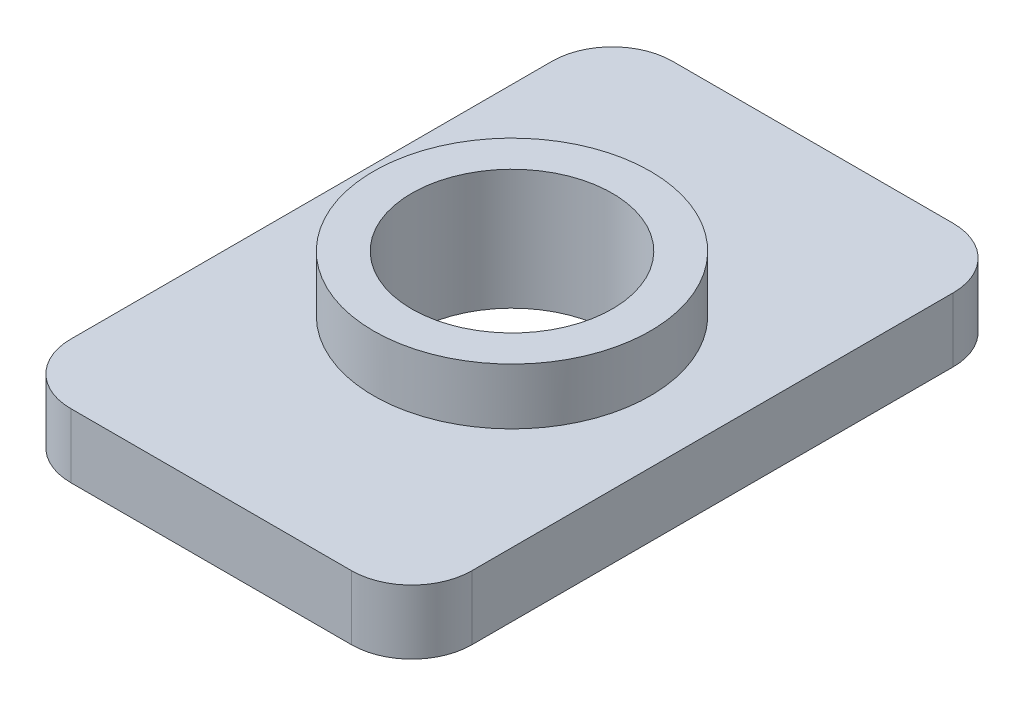
ISO-10303-21;
HEADER;
FILE_DESCRIPTION(('STEP AP214'),'2;1');
FILE_NAME('part.step','',(''),(''),'','','');
FILE_SCHEMA(('AUTOMOTIVE_DESIGN { 1 0 10303 214 1 1 1 1 }'));
ENDSEC;
DATA;
#1=APPLICATION_CONTEXT('core data for automotive mechanical design processes');
#2=APPLICATION_PROTOCOL_DEFINITION('international standard','automotive_design',2000,#1);
#3=PRODUCT_CONTEXT('',#1,'mechanical');
#4=PRODUCT('Part','Part','',(#3));
#5=PRODUCT_RELATED_PRODUCT_CATEGORY('part','',(#4));
#6=PRODUCT_DEFINITION_FORMATION('','',#4);
#7=PRODUCT_DEFINITION_CONTEXT('part definition',#1,'design');
#8=PRODUCT_DEFINITION('design','',#6,#7);
#9=PRODUCT_DEFINITION_SHAPE('','',#8);
#10=(LENGTH_UNIT() NAMED_UNIT(*) SI_UNIT(.MILLI.,.METRE.));
#11=(NAMED_UNIT(*) PLANE_ANGLE_UNIT() SI_UNIT($,.RADIAN.));
#12=(NAMED_UNIT(*) SI_UNIT($,.STERADIAN.) SOLID_ANGLE_UNIT());
#13=UNCERTAINTY_MEASURE_WITH_UNIT(LENGTH_MEASURE(1.E-05),#10,'distance_accuracy_value','');
#14=(GEOMETRIC_REPRESENTATION_CONTEXT(3) GLOBAL_UNCERTAINTY_ASSIGNED_CONTEXT((#13)) GLOBAL_UNIT_ASSIGNED_CONTEXT((#10,
#11,#12)) REPRESENTATION_CONTEXT('',''));
#15=CARTESIAN_POINT('',(0.,0.,0.));
#16=DIRECTION('',(0.,0.,1.));
#17=DIRECTION('',(1.,0.,0.));
#18=AXIS2_PLACEMENT_3D('',#15,#16,#17);
#19=CARTESIAN_POINT('',(0.,1.6,0.));
#20=DIRECTION('',(0.,-1.,0.));
#21=DIRECTION('',(0.,0.,-1.));
#22=AXIS2_PLACEMENT_3D('',#19,#20,#21);
#23=PLANE('',#22);
#24=DIRECTION('',(0.,0.,-1.));
#25=VECTOR('',#24,1.);
#26=CARTESIAN_POINT('',(5.,1.6,-7.5));
#27=LINE('',#26,#25);
#28=CARTESIAN_POINT('',(5.,1.6,6.));
#29=VERTEX_POINT('',#28);
#30=CARTESIAN_POINT('',(5.,1.6,-6.));
#31=VERTEX_POINT('',#30);
#32=EDGE_CURVE('E168',#29,#31,#27,.T.);
#33=ORIENTED_EDGE('',*,*,#32,.T.);
#34=CARTESIAN_POINT('',(3.5,1.6,-6.));
#35=DIRECTION('',(0.,-1.,0.));
#36=DIRECTION('',(0.,0.,-1.));
#37=AXIS2_PLACEMENT_3D('',#34,#35,#36);
#38=CIRCLE('',#37,1.5);
#39=CARTESIAN_POINT('',(3.5,1.6,-7.5));
#40=VERTEX_POINT('',#39);
#41=EDGE_CURVE('E150',#31,#40,#38,.F.);
#42=ORIENTED_EDGE('',*,*,#41,.T.);
#43=DIRECTION('',(-1.,0.,0.));
#44=VECTOR('',#43,1.);
#45=CARTESIAN_POINT('',(5.,1.6,-7.5));
#46=LINE('',#45,#44);
#47=CARTESIAN_POINT('',(-3.5,1.6,-7.5));
#48=VERTEX_POINT('',#47);
#49=EDGE_CURVE('E121',#40,#48,#46,.T.);
#50=ORIENTED_EDGE('',*,*,#49,.T.);
#51=CARTESIAN_POINT('',(-3.5,1.6,-6.));
#52=DIRECTION('',(0.,-1.,0.));
#53=DIRECTION('',(0.,0.,-1.));
#54=AXIS2_PLACEMENT_3D('',#51,#52,#53);
#55=CIRCLE('',#54,1.5);
#56=CARTESIAN_POINT('',(-5.,1.6,-6.));
#57=VERTEX_POINT('',#56);
#58=EDGE_CURVE('E148',#48,#57,#55,.F.);
#59=ORIENTED_EDGE('',*,*,#58,.T.);
#60=DIRECTION('',(0.,0.,1.));
#61=VECTOR('',#60,1.);
#62=CARTESIAN_POINT('',(-5.,1.6,-7.5));
#63=LINE('',#62,#61);
#64=CARTESIAN_POINT('',(-5.,1.6,6.));
#65=VERTEX_POINT('',#64);
#66=EDGE_CURVE('E128',#57,#65,#63,.T.);
#67=ORIENTED_EDGE('',*,*,#66,.T.);
#68=CARTESIAN_POINT('',(-3.5,1.6,6.));
#69=DIRECTION('',(0.,-1.,0.));
#70=DIRECTION('',(0.,0.,-1.));
#71=AXIS2_PLACEMENT_3D('',#68,#69,#70);
#72=CIRCLE('',#71,1.5);
#73=CARTESIAN_POINT('',(-3.5,1.6,7.5));
#74=VERTEX_POINT('',#73);
#75=EDGE_CURVE('E56',#65,#74,#72,.F.);
#76=ORIENTED_EDGE('',*,*,#75,.T.);
#77=DIRECTION('',(1.,0.,0.));
#78=VECTOR('',#77,1.);
#79=CARTESIAN_POINT('',(5.,1.6,7.5));
#80=LINE('',#79,#78);
#81=CARTESIAN_POINT('',(3.5,1.6,7.5));
#82=VERTEX_POINT('',#81);
#83=EDGE_CURVE('E131',#74,#82,#80,.T.);
#84=ORIENTED_EDGE('',*,*,#83,.T.);
#85=CARTESIAN_POINT('',(3.5,1.6,6.));
#86=DIRECTION('',(0.,-1.,0.));
#87=DIRECTION('',(0.,0.,-1.));
#88=AXIS2_PLACEMENT_3D('',#85,#86,#87);
#89=CIRCLE('',#88,1.5);
#90=EDGE_CURVE('E145',#82,#29,#89,.F.);
#91=ORIENTED_EDGE('',*,*,#90,.T.);
#92=EDGE_LOOP('',(#33,#42,#50,#59,#67,#76,#84,#91));
#93=FACE_BOUND('',#92,.T.);
#94=CARTESIAN_POINT('',(0.,1.6,0.));
#95=DIRECTION('',(0.,-1.,0.));
#96=DIRECTION('',(0.,0.,-1.));
#97=AXIS2_PLACEMENT_3D('',#94,#95,#96);
#98=CIRCLE('',#97,3.45);
#99=CARTESIAN_POINT('',(0.,1.6,-3.45));
#100=VERTEX_POINT('',#99);
#101=EDGE_CURVE('E11',#100,#100,#98,.F.);
#102=ORIENTED_EDGE('',*,*,#101,.F.);
#103=EDGE_LOOP('',(#102));
#104=FACE_BOUND('',#103,.T.);
#105=ADVANCED_FACE('F34',(#93,#104),#23,.F.);
#106=CARTESIAN_POINT('',(0.,0.,0.));
#107=DIRECTION('',(0.,-1.,0.));
#108=DIRECTION('',(0.,0.,-1.));
#109=AXIS2_PLACEMENT_3D('',#106,#107,#108);
#110=PLANE('',#109);
#111=DIRECTION('',(-1.,0.,0.));
#112=VECTOR('',#111,1.);
#113=CARTESIAN_POINT('',(5.,0.,-7.5));
#114=LINE('',#113,#112);
#115=CARTESIAN_POINT('',(3.5,0.,-7.5));
#116=VERTEX_POINT('',#115);
#117=CARTESIAN_POINT('',(-3.5,0.,-7.5));
#118=VERTEX_POINT('',#117);
#119=EDGE_CURVE('E118',#116,#118,#114,.T.);
#120=ORIENTED_EDGE('',*,*,#119,.F.);
#121=CARTESIAN_POINT('',(3.5,0.,-6.));
#122=DIRECTION('',(0.,-1.,0.));
#123=DIRECTION('',(0.,0.,-1.));
#124=AXIS2_PLACEMENT_3D('',#121,#122,#123);
#125=CIRCLE('',#124,1.5);
#126=CARTESIAN_POINT('',(5.,0.,-6.));
#127=VERTEX_POINT('',#126);
#128=EDGE_CURVE('E101',#116,#127,#125,.T.);
#129=ORIENTED_EDGE('',*,*,#128,.T.);
#130=DIRECTION('',(0.,0.,-1.));
#131=VECTOR('',#130,1.);
#132=CARTESIAN_POINT('',(5.,0.,-7.5));
#133=LINE('',#132,#131);
#134=CARTESIAN_POINT('',(5.,0.,6.));
#135=VERTEX_POINT('',#134);
#136=EDGE_CURVE('E129',#135,#127,#133,.T.);
#137=ORIENTED_EDGE('',*,*,#136,.F.);
#138=CARTESIAN_POINT('',(3.5,0.,6.));
#139=DIRECTION('',(0.,-1.,0.));
#140=DIRECTION('',(0.,0.,-1.));
#141=AXIS2_PLACEMENT_3D('',#138,#139,#140);
#142=CIRCLE('',#141,1.5);
#143=CARTESIAN_POINT('',(3.5,0.,7.5));
#144=VERTEX_POINT('',#143);
#145=EDGE_CURVE('E122',#135,#144,#142,.T.);
#146=ORIENTED_EDGE('',*,*,#145,.T.);
#147=DIRECTION('',(1.,0.,0.));
#148=VECTOR('',#147,1.);
#149=CARTESIAN_POINT('',(5.,0.,7.5));
#150=LINE('',#149,#148);
#151=CARTESIAN_POINT('',(-3.5,0.,7.5));
#152=VERTEX_POINT('',#151);
#153=EDGE_CURVE('E133',#152,#144,#150,.T.);
#154=ORIENTED_EDGE('',*,*,#153,.F.);
#155=CARTESIAN_POINT('',(-3.5,0.,6.));
#156=DIRECTION('',(0.,-1.,0.));
#157=DIRECTION('',(0.,0.,-1.));
#158=AXIS2_PLACEMENT_3D('',#155,#156,#157);
#159=CIRCLE('',#158,1.5);
#160=CARTESIAN_POINT('',(-5.,0.,6.));
#161=VERTEX_POINT('',#160);
#162=EDGE_CURVE('E139',#152,#161,#159,.T.);
#163=ORIENTED_EDGE('',*,*,#162,.T.);
#164=DIRECTION('',(0.,0.,1.));
#165=VECTOR('',#164,1.);
#166=CARTESIAN_POINT('',(-5.,0.,-7.5));
#167=LINE('',#166,#165);
#168=CARTESIAN_POINT('',(-5.,0.,-6.));
#169=VERTEX_POINT('',#168);
#170=EDGE_CURVE('E163',#169,#161,#167,.T.);
#171=ORIENTED_EDGE('',*,*,#170,.F.);
#172=CARTESIAN_POINT('',(-3.5,0.,-6.));
#173=DIRECTION('',(0.,-1.,0.));
#174=DIRECTION('',(0.,0.,-1.));
#175=AXIS2_PLACEMENT_3D('',#172,#173,#174);
#176=CIRCLE('',#175,1.5);
#177=EDGE_CURVE('E112',#169,#118,#176,.T.);
#178=ORIENTED_EDGE('',*,*,#177,.T.);
#179=EDGE_LOOP('',(#120,#129,#137,#146,#154,#163,#171,#178));
#180=FACE_BOUND('',#179,.T.);
#181=CARTESIAN_POINT('',(0.,0.,0.));
#182=DIRECTION('',(0.,1.,0.));
#183=DIRECTION('',(0.,0.,1.));
#184=AXIS2_PLACEMENT_3D('',#181,#182,#183);
#185=CIRCLE('',#184,2.5);
#186=CARTESIAN_POINT('',(0.,0.,2.5));
#187=VERTEX_POINT('',#186);
#188=EDGE_CURVE('E164',#187,#187,#185,.T.);
#189=ORIENTED_EDGE('',*,*,#188,.T.);
#190=EDGE_LOOP('',(#189));
#191=FACE_BOUND('',#190,.T.);
#192=ADVANCED_FACE('F125',(#180,#191),#110,.T.);
#193=CARTESIAN_POINT('',(-5.,1.6,-7.5));
#194=DIRECTION('',(1.,0.,0.));
#195=DIRECTION('',(0.,0.,-1.));
#196=AXIS2_PLACEMENT_3D('',#193,#194,#195);
#197=PLANE('',#196);
#198=ORIENTED_EDGE('',*,*,#66,.F.);
#199=DIRECTION('',(0.,-1.,0.));
#200=VECTOR('',#199,1.);
#201=CARTESIAN_POINT('',(-5.,1.6,-6.));
#202=LINE('',#201,#200);
#203=EDGE_CURVE('E154',#57,#169,#202,.T.);
#204=ORIENTED_EDGE('',*,*,#203,.T.);
#205=ORIENTED_EDGE('',*,*,#170,.T.);
#206=DIRECTION('',(0.,-1.,0.));
#207=VECTOR('',#206,1.);
#208=CARTESIAN_POINT('',(-5.,1.6,6.));
#209=LINE('',#208,#207);
#210=EDGE_CURVE('E152',#161,#65,#209,.F.);
#211=ORIENTED_EDGE('',*,*,#210,.T.);
#212=EDGE_LOOP('',(#198,#204,#205,#211));
#213=FACE_BOUND('',#212,.T.);
#214=ADVANCED_FACE('F201',(#213),#197,.F.);
#215=CARTESIAN_POINT('',(5.,1.6,7.5));
#216=DIRECTION('',(0.,0.,-1.));
#217=DIRECTION('',(-1.,0.,0.));
#218=AXIS2_PLACEMENT_3D('',#215,#216,#217);
#219=PLANE('',#218);
#220=ORIENTED_EDGE('',*,*,#83,.F.);
#221=DIRECTION('',(0.,-1.,0.));
#222=VECTOR('',#221,1.);
#223=CARTESIAN_POINT('',(-3.5,1.6,7.5));
#224=LINE('',#223,#222);
#225=EDGE_CURVE('E42',#74,#152,#224,.T.);
#226=ORIENTED_EDGE('',*,*,#225,.T.);
#227=ORIENTED_EDGE('',*,*,#153,.T.);
#228=DIRECTION('',(0.,-1.,0.));
#229=VECTOR('',#228,1.);
#230=CARTESIAN_POINT('',(3.5,1.6,7.5));
#231=LINE('',#230,#229);
#232=EDGE_CURVE('E49',#144,#82,#231,.F.);
#233=ORIENTED_EDGE('',*,*,#232,.T.);
#234=EDGE_LOOP('',(#220,#226,#227,#233));
#235=FACE_BOUND('',#234,.T.);
#236=ADVANCED_FACE('F160',(#235),#219,.F.);
#237=CARTESIAN_POINT('',(5.,1.6,-7.5));
#238=DIRECTION('',(-1.,0.,0.));
#239=DIRECTION('',(0.,0.,1.));
#240=AXIS2_PLACEMENT_3D('',#237,#238,#239);
#241=PLANE('',#240);
#242=ORIENTED_EDGE('',*,*,#136,.T.);
#243=DIRECTION('',(0.,-1.,0.));
#244=VECTOR('',#243,1.);
#245=CARTESIAN_POINT('',(5.,1.6,-6.));
#246=LINE('',#245,#244);
#247=EDGE_CURVE('E106',#127,#31,#246,.F.);
#248=ORIENTED_EDGE('',*,*,#247,.T.);
#249=ORIENTED_EDGE('',*,*,#32,.F.);
#250=DIRECTION('',(0.,-1.,0.));
#251=VECTOR('',#250,1.);
#252=CARTESIAN_POINT('',(5.,1.6,6.));
#253=LINE('',#252,#251);
#254=EDGE_CURVE('E111',#29,#135,#253,.T.);
#255=ORIENTED_EDGE('',*,*,#254,.T.);
#256=EDGE_LOOP('',(#242,#248,#249,#255));
#257=FACE_BOUND('',#256,.T.);
#258=ADVANCED_FACE('F208',(#257),#241,.F.);
#259=CARTESIAN_POINT('',(5.,1.6,-7.5));
#260=DIRECTION('',(0.,0.,1.));
#261=DIRECTION('',(1.,0.,0.));
#262=AXIS2_PLACEMENT_3D('',#259,#260,#261);
#263=PLANE('',#262);
#264=ORIENTED_EDGE('',*,*,#49,.F.);
#265=DIRECTION('',(0.,-1.,0.));
#266=VECTOR('',#265,1.);
#267=CARTESIAN_POINT('',(3.5,1.6,-7.5));
#268=LINE('',#267,#266);
#269=EDGE_CURVE('E105',#40,#116,#268,.T.);
#270=ORIENTED_EDGE('',*,*,#269,.T.);
#271=ORIENTED_EDGE('',*,*,#119,.T.);
#272=DIRECTION('',(0.,-1.,0.));
#273=VECTOR('',#272,1.);
#274=CARTESIAN_POINT('',(-3.5,1.6,-7.5));
#275=LINE('',#274,#273);
#276=EDGE_CURVE('E123',#118,#48,#275,.F.);
#277=ORIENTED_EDGE('',*,*,#276,.T.);
#278=EDGE_LOOP('',(#264,#270,#271,#277));
#279=FACE_BOUND('',#278,.T.);
#280=ADVANCED_FACE('F117',(#279),#263,.F.);
#281=CARTESIAN_POINT('',(0.,1.6,0.));
#282=DIRECTION('',(0.,-1.,0.));
#283=DIRECTION('',(0.,0.,-1.));
#284=AXIS2_PLACEMENT_3D('',#281,#282,#283);
#285=CYLINDRICAL_SURFACE('',#284,2.5);
#286=ORIENTED_EDGE('',*,*,#188,.F.);
#287=EDGE_LOOP('',(#286));
#288=FACE_BOUND('',#287,.T.);
#289=CARTESIAN_POINT('',(0.,3.,0.));
#290=DIRECTION('',(0.,1.,0.));
#291=DIRECTION('',(0.,0.,1.));
#292=AXIS2_PLACEMENT_3D('',#289,#290,#291);
#293=CIRCLE('',#292,2.5);
#294=CARTESIAN_POINT('',(0.,3.,2.5));
#295=VERTEX_POINT('',#294);
#296=EDGE_CURVE('E177',#295,#295,#293,.T.);
#297=ORIENTED_EDGE('',*,*,#296,.T.);
#298=EDGE_LOOP('',(#297));
#299=FACE_BOUND('',#298,.T.);
#300=ADVANCED_FACE('F181',(#288,#299),#285,.F.);
#301=CARTESIAN_POINT('',(3.5,1.6,-6.));
#302=DIRECTION('',(0.,-1.,0.));
#303=DIRECTION('',(0.,0.,-1.));
#304=AXIS2_PLACEMENT_3D('',#301,#302,#303);
#305=CYLINDRICAL_SURFACE('',#304,1.5);
#306=ORIENTED_EDGE('',*,*,#41,.F.);
#307=ORIENTED_EDGE('',*,*,#247,.F.);
#308=ORIENTED_EDGE('',*,*,#128,.F.);
#309=ORIENTED_EDGE('',*,*,#269,.F.);
#310=EDGE_LOOP('',(#306,#307,#308,#309));
#311=FACE_BOUND('',#310,.T.);
#312=ADVANCED_FACE('F104',(#311),#305,.T.);
#313=CARTESIAN_POINT('',(-3.5,1.6,-6.));
#314=DIRECTION('',(0.,-1.,0.));
#315=DIRECTION('',(0.,0.,-1.));
#316=AXIS2_PLACEMENT_3D('',#313,#314,#315);
#317=CYLINDRICAL_SURFACE('',#316,1.5);
#318=ORIENTED_EDGE('',*,*,#58,.F.);
#319=ORIENTED_EDGE('',*,*,#276,.F.);
#320=ORIENTED_EDGE('',*,*,#177,.F.);
#321=ORIENTED_EDGE('',*,*,#203,.F.);
#322=EDGE_LOOP('',(#318,#319,#320,#321));
#323=FACE_BOUND('',#322,.T.);
#324=ADVANCED_FACE('F219',(#323),#317,.T.);
#325=CARTESIAN_POINT('',(-3.5,1.6,6.));
#326=DIRECTION('',(0.,-1.,0.));
#327=DIRECTION('',(0.,0.,-1.));
#328=AXIS2_PLACEMENT_3D('',#325,#326,#327);
#329=CYLINDRICAL_SURFACE('',#328,1.5);
#330=ORIENTED_EDGE('',*,*,#75,.F.);
#331=ORIENTED_EDGE('',*,*,#210,.F.);
#332=ORIENTED_EDGE('',*,*,#162,.F.);
#333=ORIENTED_EDGE('',*,*,#225,.F.);
#334=EDGE_LOOP('',(#330,#331,#332,#333));
#335=FACE_BOUND('',#334,.T.);
#336=ADVANCED_FACE('F194',(#335),#329,.T.);
#337=CARTESIAN_POINT('',(3.5,1.6,6.));
#338=DIRECTION('',(0.,-1.,0.));
#339=DIRECTION('',(0.,0.,-1.));
#340=AXIS2_PLACEMENT_3D('',#337,#338,#339);
#341=CYLINDRICAL_SURFACE('',#340,1.5);
#342=ORIENTED_EDGE('',*,*,#90,.F.);
#343=ORIENTED_EDGE('',*,*,#232,.F.);
#344=ORIENTED_EDGE('',*,*,#145,.F.);
#345=ORIENTED_EDGE('',*,*,#254,.F.);
#346=EDGE_LOOP('',(#342,#343,#344,#345));
#347=FACE_BOUND('',#346,.T.);
#348=ADVANCED_FACE('F36',(#347),#341,.T.);
#349=CARTESIAN_POINT('',(0.,3.,0.));
#350=DIRECTION('',(0.,1.,0.));
#351=DIRECTION('',(0.,0.,1.));
#352=AXIS2_PLACEMENT_3D('',#349,#350,#351);
#353=PLANE('',#352);
#354=CARTESIAN_POINT('',(0.,3.,0.));
#355=DIRECTION('',(0.,1.,0.));
#356=DIRECTION('',(0.,0.,1.));
#357=AXIS2_PLACEMENT_3D('',#354,#355,#356);
#358=CIRCLE('',#357,3.45);
#359=CARTESIAN_POINT('',(0.,3.,3.45));
#360=VERTEX_POINT('',#359);
#361=EDGE_CURVE('E174',#360,#360,#358,.T.);
#362=ORIENTED_EDGE('',*,*,#361,.T.);
#363=EDGE_LOOP('',(#362));
#364=FACE_BOUND('',#363,.T.);
#365=ORIENTED_EDGE('',*,*,#296,.F.);
#366=EDGE_LOOP('',(#365));
#367=FACE_BOUND('',#366,.T.);
#368=ADVANCED_FACE('F183',(#364,#367),#353,.T.);
#369=CARTESIAN_POINT('',(0.,3.,0.));
#370=DIRECTION('',(0.,-1.,0.));
#371=DIRECTION('',(0.,0.,-1.));
#372=AXIS2_PLACEMENT_3D('',#369,#370,#371);
#373=CYLINDRICAL_SURFACE('',#372,3.45);
#374=ORIENTED_EDGE('',*,*,#361,.F.);
#375=EDGE_LOOP('',(#374));
#376=FACE_BOUND('',#375,.T.);
#377=ORIENTED_EDGE('',*,*,#101,.T.);
#378=EDGE_LOOP('',(#377));
#379=FACE_BOUND('',#378,.T.);
#380=ADVANCED_FACE('F185',(#376,#379),#373,.T.);
#381=CLOSED_SHELL('',(#105,#192,#214,#236,#258,#280,#300,#312,#324,#336,#348,#368,#380));
#382=MANIFOLD_SOLID_BREP('B2',#381);
#383=ADVANCED_BREP_SHAPE_REPRESENTATION('',(#18,#382),#14);
#384=SHAPE_DEFINITION_REPRESENTATION(#9,#383);
ENDSEC;
END-ISO-10303-21;
